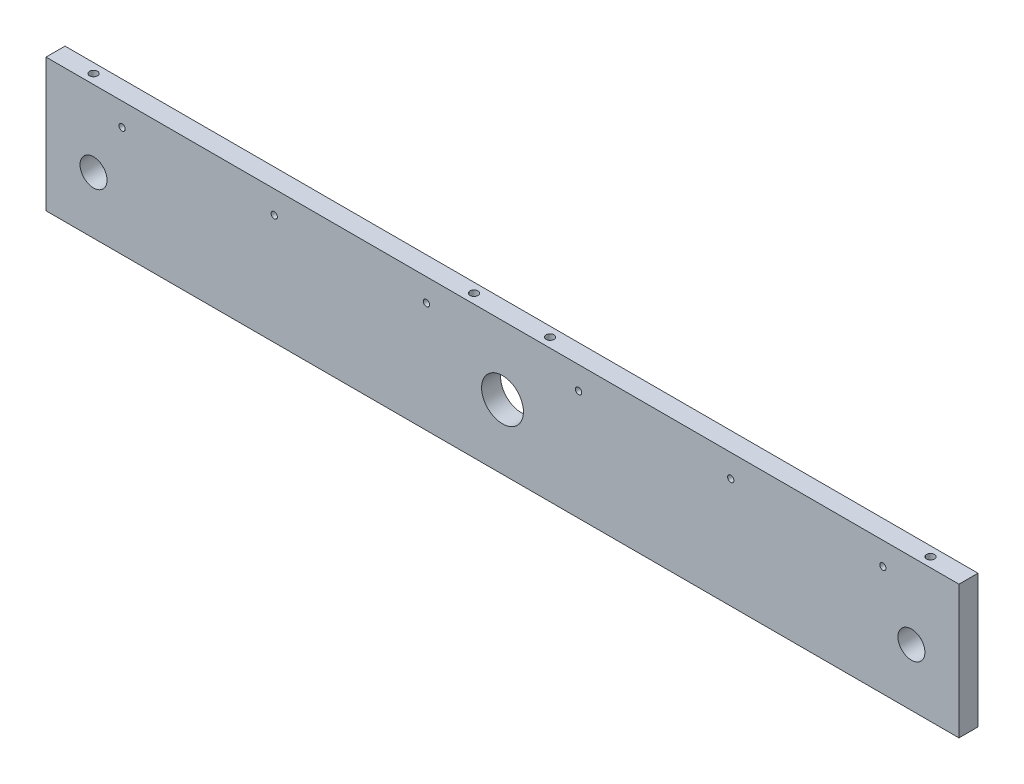
ISO-10303-21;
HEADER;
FILE_DESCRIPTION(('STEP AP214'),'2;1');
FILE_NAME('part.step','',(''),(''),'','','');
FILE_SCHEMA(('AUTOMOTIVE_DESIGN { 1 0 10303 214 1 1 1 1 }'));
ENDSEC;
DATA;
#1=APPLICATION_CONTEXT('core data for automotive mechanical design processes');
#2=APPLICATION_PROTOCOL_DEFINITION('international standard','automotive_design',2000,#1);
#3=PRODUCT_CONTEXT('',#1,'mechanical');
#4=PRODUCT('Part','Part','',(#3));
#5=PRODUCT_RELATED_PRODUCT_CATEGORY('part','',(#4));
#6=PRODUCT_DEFINITION_FORMATION('','',#4);
#7=PRODUCT_DEFINITION_CONTEXT('part definition',#1,'design');
#8=PRODUCT_DEFINITION('design','',#6,#7);
#9=PRODUCT_DEFINITION_SHAPE('','',#8);
#10=(LENGTH_UNIT() NAMED_UNIT(*) SI_UNIT(.MILLI.,.METRE.));
#11=(NAMED_UNIT(*) PLANE_ANGLE_UNIT() SI_UNIT($,.RADIAN.));
#12=(NAMED_UNIT(*) SI_UNIT($,.STERADIAN.) SOLID_ANGLE_UNIT());
#13=UNCERTAINTY_MEASURE_WITH_UNIT(LENGTH_MEASURE(1.E-05),#10,'distance_accuracy_value','');
#14=(GEOMETRIC_REPRESENTATION_CONTEXT(3) GLOBAL_UNCERTAINTY_ASSIGNED_CONTEXT((#13)) GLOBAL_UNIT_ASSIGNED_CONTEXT((#10,
#11,#12)) REPRESENTATION_CONTEXT('',''));
#15=CARTESIAN_POINT('',(0.,0.,0.));
#16=DIRECTION('',(0.,0.,1.));
#17=DIRECTION('',(1.,0.,0.));
#18=AXIS2_PLACEMENT_3D('',#15,#16,#17);
#19=CARTESIAN_POINT('',(0.,0.,10.));
#20=DIRECTION('',(0.,0.,1.));
#21=DIRECTION('',(1.,0.,0.));
#22=AXIS2_PLACEMENT_3D('',#19,#20,#21);
#23=PLANE('',#22);
#24=CARTESIAN_POINT('',(-200.,23.,10.));
#25=DIRECTION('',(0.,0.,1.));
#26=DIRECTION('',(1.,0.,0.));
#27=AXIS2_PLACEMENT_3D('',#24,#25,#26);
#28=CIRCLE('',#27,1.65000000000001);
#29=CARTESIAN_POINT('',(-198.35,23.,10.));
#30=VERTEX_POINT('',#29);
#31=EDGE_CURVE('E337',#30,#30,#28,.T.);
#32=ORIENTED_EDGE('',*,*,#31,.F.);
#33=EDGE_LOOP('',(#32));
#34=FACE_BOUND('',#33,.T.);
#35=CARTESIAN_POINT('',(-120.,23.,10.));
#36=DIRECTION('',(0.,0.,1.));
#37=DIRECTION('',(1.,0.,0.));
#38=AXIS2_PLACEMENT_3D('',#35,#36,#37);
#39=CIRCLE('',#38,1.65);
#40=CARTESIAN_POINT('',(-118.35,23.,10.));
#41=VERTEX_POINT('',#40);
#42=EDGE_CURVE('E341',#41,#41,#39,.T.);
#43=ORIENTED_EDGE('',*,*,#42,.F.);
#44=EDGE_LOOP('',(#43));
#45=FACE_BOUND('',#44,.T.);
#46=CARTESIAN_POINT('',(-40.,23.,10.));
#47=DIRECTION('',(0.,0.,1.));
#48=DIRECTION('',(1.,0.,0.));
#49=AXIS2_PLACEMENT_3D('',#46,#47,#48);
#50=CIRCLE('',#49,1.65);
#51=CARTESIAN_POINT('',(-38.35,23.,10.));
#52=VERTEX_POINT('',#51);
#53=EDGE_CURVE('E351',#52,#52,#50,.T.);
#54=ORIENTED_EDGE('',*,*,#53,.F.);
#55=EDGE_LOOP('',(#54));
#56=FACE_BOUND('',#55,.T.);
#57=CARTESIAN_POINT('',(40.,23.,10.));
#58=DIRECTION('',(0.,0.,1.));
#59=DIRECTION('',(1.,0.,0.));
#60=AXIS2_PLACEMENT_3D('',#57,#58,#59);
#61=CIRCLE('',#60,1.65);
#62=CARTESIAN_POINT('',(41.65,23.,10.));
#63=VERTEX_POINT('',#62);
#64=EDGE_CURVE('E359',#63,#63,#61,.T.);
#65=ORIENTED_EDGE('',*,*,#64,.F.);
#66=EDGE_LOOP('',(#65));
#67=FACE_BOUND('',#66,.T.);
#68=CARTESIAN_POINT('',(120.,23.,10.));
#69=DIRECTION('',(0.,0.,1.));
#70=DIRECTION('',(1.,0.,0.));
#71=AXIS2_PLACEMENT_3D('',#68,#69,#70);
#72=CIRCLE('',#71,1.65);
#73=CARTESIAN_POINT('',(121.65,23.,10.));
#74=VERTEX_POINT('',#73);
#75=EDGE_CURVE('E367',#74,#74,#72,.T.);
#76=ORIENTED_EDGE('',*,*,#75,.F.);
#77=EDGE_LOOP('',(#76));
#78=FACE_BOUND('',#77,.T.);
#79=CARTESIAN_POINT('',(200.,23.,10.));
#80=DIRECTION('',(0.,0.,1.));
#81=DIRECTION('',(1.,0.,0.));
#82=AXIS2_PLACEMENT_3D('',#79,#80,#81);
#83=CIRCLE('',#82,1.65000000000001);
#84=CARTESIAN_POINT('',(201.65,23.,10.));
#85=VERTEX_POINT('',#84);
#86=EDGE_CURVE('E375',#85,#85,#83,.T.);
#87=ORIENTED_EDGE('',*,*,#86,.F.);
#88=EDGE_LOOP('',(#87));
#89=FACE_BOUND('',#88,.T.);
#90=CARTESIAN_POINT('',(-215.,-4.99999999999998,10.));
#91=DIRECTION('',(0.,0.,1.));
#92=DIRECTION('',(1.,0.,0.));
#93=AXIS2_PLACEMENT_3D('',#90,#91,#92);
#94=CIRCLE('',#93,7.10000000000001);
#95=CARTESIAN_POINT('',(-207.9,-4.99999999999998,10.));
#96=VERTEX_POINT('',#95);
#97=EDGE_CURVE('E181',#96,#96,#94,.T.);
#98=ORIENTED_EDGE('',*,*,#97,.F.);
#99=EDGE_LOOP('',(#98));
#100=FACE_BOUND('',#99,.T.);
#101=DIRECTION('',(0.,1.,0.));
#102=VECTOR('',#101,1.);
#103=CARTESIAN_POINT('',(240.,35.,10.));
#104=LINE('',#103,#102);
#105=CARTESIAN_POINT('',(240.,-35.,10.));
#106=VERTEX_POINT('',#105);
#107=CARTESIAN_POINT('',(240.,35.,10.));
#108=VERTEX_POINT('',#107);
#109=EDGE_CURVE('E197',#106,#108,#104,.T.);
#110=ORIENTED_EDGE('',*,*,#109,.T.);
#111=DIRECTION('',(-1.,0.,0.));
#112=VECTOR('',#111,1.);
#113=CARTESIAN_POINT('',(-240.,35.,10.));
#114=LINE('',#113,#112);
#115=CARTESIAN_POINT('',(-240.,35.,10.));
#116=VERTEX_POINT('',#115);
#117=EDGE_CURVE('E94',#108,#116,#114,.T.);
#118=ORIENTED_EDGE('',*,*,#117,.T.);
#119=DIRECTION('',(0.,-1.,0.));
#120=VECTOR('',#119,1.);
#121=CARTESIAN_POINT('',(-240.,35.,10.));
#122=LINE('',#121,#120);
#123=CARTESIAN_POINT('',(-240.,-35.,10.));
#124=VERTEX_POINT('',#123);
#125=EDGE_CURVE('E202',#116,#124,#122,.T.);
#126=ORIENTED_EDGE('',*,*,#125,.T.);
#127=DIRECTION('',(1.,0.,0.));
#128=VECTOR('',#127,1.);
#129=CARTESIAN_POINT('',(-240.,-35.,10.));
#130=LINE('',#129,#128);
#131=EDGE_CURVE('E63',#124,#106,#130,.T.);
#132=ORIENTED_EDGE('',*,*,#131,.T.);
#133=EDGE_LOOP('',(#110,#118,#126,#132));
#134=FACE_BOUND('',#133,.T.);
#135=CARTESIAN_POINT('',(0.,-0.999999999999973,10.));
#136=DIRECTION('',(0.,0.,1.));
#137=DIRECTION('',(1.,0.,0.));
#138=AXIS2_PLACEMENT_3D('',#135,#136,#137);
#139=CIRCLE('',#138,11.);
#140=CARTESIAN_POINT('',(11.,-0.999999999999973,10.));
#141=VERTEX_POINT('',#140);
#142=EDGE_CURVE('E189',#141,#141,#139,.T.);
#143=ORIENTED_EDGE('',*,*,#142,.F.);
#144=EDGE_LOOP('',(#143));
#145=FACE_BOUND('',#144,.T.);
#146=CARTESIAN_POINT('',(215.,-4.99999999999992,10.));
#147=DIRECTION('',(0.,0.,1.));
#148=DIRECTION('',(-1.,0.,0.));
#149=AXIS2_PLACEMENT_3D('',#146,#147,#148);
#150=CIRCLE('',#149,7.10000000000001);
#151=CARTESIAN_POINT('',(207.9,-4.99999999999992,10.));
#152=VERTEX_POINT('',#151);
#153=EDGE_CURVE('E173',#152,#152,#150,.T.);
#154=ORIENTED_EDGE('',*,*,#153,.F.);
#155=EDGE_LOOP('',(#154));
#156=FACE_BOUND('',#155,.T.);
#157=ADVANCED_FACE('F45',(#34,#45,#56,#67,#78,#89,#100,#134,#145,#156),#23,.T.);
#158=CARTESIAN_POINT('',(0.,0.,0.));
#159=DIRECTION('',(0.,0.,1.));
#160=DIRECTION('',(1.,0.,0.));
#161=AXIS2_PLACEMENT_3D('',#158,#159,#160);
#162=PLANE('',#161);
#163=CARTESIAN_POINT('',(-200.,23.,0.));
#164=DIRECTION('',(0.,0.,1.));
#165=DIRECTION('',(1.,0.,0.));
#166=AXIS2_PLACEMENT_3D('',#163,#164,#165);
#167=CIRCLE('',#166,1.64999999999998);
#168=CARTESIAN_POINT('',(-198.35,23.,0.));
#169=VERTEX_POINT('',#168);
#170=EDGE_CURVE('E335',#169,#169,#167,.T.);
#171=ORIENTED_EDGE('',*,*,#170,.T.);
#172=EDGE_LOOP('',(#171));
#173=FACE_BOUND('',#172,.T.);
#174=CARTESIAN_POINT('',(-120.,23.,0.));
#175=DIRECTION('',(0.,0.,1.));
#176=DIRECTION('',(1.,0.,0.));
#177=AXIS2_PLACEMENT_3D('',#174,#175,#176);
#178=CIRCLE('',#177,1.65);
#179=CARTESIAN_POINT('',(-118.35,23.,0.));
#180=VERTEX_POINT('',#179);
#181=EDGE_CURVE('E347',#180,#180,#178,.T.);
#182=ORIENTED_EDGE('',*,*,#181,.T.);
#183=EDGE_LOOP('',(#182));
#184=FACE_BOUND('',#183,.T.);
#185=CARTESIAN_POINT('',(-40.,23.,0.));
#186=DIRECTION('',(0.,0.,1.));
#187=DIRECTION('',(1.,0.,0.));
#188=AXIS2_PLACEMENT_3D('',#185,#186,#187);
#189=CIRCLE('',#188,1.65);
#190=CARTESIAN_POINT('',(-38.35,23.,0.));
#191=VERTEX_POINT('',#190);
#192=EDGE_CURVE('E355',#191,#191,#189,.T.);
#193=ORIENTED_EDGE('',*,*,#192,.T.);
#194=EDGE_LOOP('',(#193));
#195=FACE_BOUND('',#194,.T.);
#196=CARTESIAN_POINT('',(40.,23.,0.));
#197=DIRECTION('',(0.,0.,1.));
#198=DIRECTION('',(1.,0.,0.));
#199=AXIS2_PLACEMENT_3D('',#196,#197,#198);
#200=CIRCLE('',#199,1.65);
#201=CARTESIAN_POINT('',(41.65,23.,0.));
#202=VERTEX_POINT('',#201);
#203=EDGE_CURVE('E363',#202,#202,#200,.T.);
#204=ORIENTED_EDGE('',*,*,#203,.T.);
#205=EDGE_LOOP('',(#204));
#206=FACE_BOUND('',#205,.T.);
#207=CARTESIAN_POINT('',(120.,23.,0.));
#208=DIRECTION('',(0.,0.,1.));
#209=DIRECTION('',(1.,0.,0.));
#210=AXIS2_PLACEMENT_3D('',#207,#208,#209);
#211=CIRCLE('',#210,1.65);
#212=CARTESIAN_POINT('',(121.65,23.,0.));
#213=VERTEX_POINT('',#212);
#214=EDGE_CURVE('E371',#213,#213,#211,.T.);
#215=ORIENTED_EDGE('',*,*,#214,.T.);
#216=EDGE_LOOP('',(#215));
#217=FACE_BOUND('',#216,.T.);
#218=CARTESIAN_POINT('',(200.,23.,0.));
#219=DIRECTION('',(0.,0.,1.));
#220=DIRECTION('',(1.,0.,0.));
#221=AXIS2_PLACEMENT_3D('',#218,#219,#220);
#222=CIRCLE('',#221,1.64999999999998);
#223=CARTESIAN_POINT('',(201.65,23.,0.));
#224=VERTEX_POINT('',#223);
#225=EDGE_CURVE('E133',#224,#224,#222,.T.);
#226=ORIENTED_EDGE('',*,*,#225,.T.);
#227=EDGE_LOOP('',(#226));
#228=FACE_BOUND('',#227,.T.);
#229=DIRECTION('',(0.,1.,0.));
#230=VECTOR('',#229,1.);
#231=CARTESIAN_POINT('',(240.,35.,0.));
#232=LINE('',#231,#230);
#233=CARTESIAN_POINT('',(240.,-35.,0.));
#234=VERTEX_POINT('',#233);
#235=CARTESIAN_POINT('',(240.,35.,0.));
#236=VERTEX_POINT('',#235);
#237=EDGE_CURVE('E193',#234,#236,#232,.T.);
#238=ORIENTED_EDGE('',*,*,#237,.F.);
#239=DIRECTION('',(1.,0.,0.));
#240=VECTOR('',#239,1.);
#241=CARTESIAN_POINT('',(-240.,-35.,0.));
#242=LINE('',#241,#240);
#243=CARTESIAN_POINT('',(-240.,-35.,0.));
#244=VERTEX_POINT('',#243);
#245=EDGE_CURVE('E87',#244,#234,#242,.T.);
#246=ORIENTED_EDGE('',*,*,#245,.F.);
#247=DIRECTION('',(0.,-1.,0.));
#248=VECTOR('',#247,1.);
#249=CARTESIAN_POINT('',(-240.,35.,0.));
#250=LINE('',#249,#248);
#251=CARTESIAN_POINT('',(-240.,35.,0.));
#252=VERTEX_POINT('',#251);
#253=EDGE_CURVE('E81',#252,#244,#250,.T.);
#254=ORIENTED_EDGE('',*,*,#253,.F.);
#255=DIRECTION('',(-1.,0.,0.));
#256=VECTOR('',#255,1.);
#257=CARTESIAN_POINT('',(-240.,35.,0.));
#258=LINE('',#257,#256);
#259=EDGE_CURVE('E211',#236,#252,#258,.T.);
#260=ORIENTED_EDGE('',*,*,#259,.F.);
#261=EDGE_LOOP('',(#238,#246,#254,#260));
#262=FACE_BOUND('',#261,.T.);
#263=CARTESIAN_POINT('',(0.,-0.999999999999973,0.));
#264=DIRECTION('',(0.,0.,1.));
#265=DIRECTION('',(1.,0.,0.));
#266=AXIS2_PLACEMENT_3D('',#263,#264,#265);
#267=CIRCLE('',#266,11.);
#268=CARTESIAN_POINT('',(11.,-0.999999999999973,0.));
#269=VERTEX_POINT('',#268);
#270=EDGE_CURVE('E185',#269,#269,#267,.T.);
#271=ORIENTED_EDGE('',*,*,#270,.T.);
#272=EDGE_LOOP('',(#271));
#273=FACE_BOUND('',#272,.T.);
#274=CARTESIAN_POINT('',(-215.,-4.99999999999998,0.));
#275=DIRECTION('',(0.,0.,1.));
#276=DIRECTION('',(1.,0.,0.));
#277=AXIS2_PLACEMENT_3D('',#274,#275,#276);
#278=CIRCLE('',#277,7.10000000000001);
#279=CARTESIAN_POINT('',(-207.9,-4.99999999999998,0.));
#280=VERTEX_POINT('',#279);
#281=EDGE_CURVE('E177',#280,#280,#278,.T.);
#282=ORIENTED_EDGE('',*,*,#281,.T.);
#283=EDGE_LOOP('',(#282));
#284=FACE_BOUND('',#283,.T.);
#285=CARTESIAN_POINT('',(215.,-4.99999999999992,0.));
#286=DIRECTION('',(0.,0.,1.));
#287=DIRECTION('',(-1.,0.,0.));
#288=AXIS2_PLACEMENT_3D('',#285,#286,#287);
#289=CIRCLE('',#288,7.10000000000001);
#290=CARTESIAN_POINT('',(207.9,-4.99999999999992,0.));
#291=VERTEX_POINT('',#290);
#292=EDGE_CURVE('E172',#291,#291,#289,.T.);
#293=ORIENTED_EDGE('',*,*,#292,.T.);
#294=EDGE_LOOP('',(#293));
#295=FACE_BOUND('',#294,.T.);
#296=ADVANCED_FACE('F227',(#173,#184,#195,#206,#217,#228,#262,#273,#284,#295),#162,.F.);
#297=CARTESIAN_POINT('',(240.,35.,10.));
#298=DIRECTION('',(-1.,0.,0.));
#299=DIRECTION('',(0.,0.,1.));
#300=AXIS2_PLACEMENT_3D('',#297,#298,#299);
#301=PLANE('',#300);
#302=ORIENTED_EDGE('',*,*,#237,.T.);
#303=DIRECTION('',(0.,0.,-1.));
#304=VECTOR('',#303,1.);
#305=CARTESIAN_POINT('',(240.,35.,10.));
#306=LINE('',#305,#304);
#307=EDGE_CURVE('E11',#108,#236,#306,.T.);
#308=ORIENTED_EDGE('',*,*,#307,.F.);
#309=ORIENTED_EDGE('',*,*,#109,.F.);
#310=DIRECTION('',(0.,0.,-1.));
#311=VECTOR('',#310,1.);
#312=CARTESIAN_POINT('',(240.,-35.,10.));
#313=LINE('',#312,#311);
#314=EDGE_CURVE('E207',#106,#234,#313,.T.);
#315=ORIENTED_EDGE('',*,*,#314,.T.);
#316=EDGE_LOOP('',(#302,#308,#309,#315));
#317=FACE_BOUND('',#316,.T.);
#318=ADVANCED_FACE('F47',(#317),#301,.F.);
#319=CARTESIAN_POINT('',(-240.,35.,10.));
#320=DIRECTION('',(0.,-1.,0.));
#321=DIRECTION('',(0.,0.,-1.));
#322=AXIS2_PLACEMENT_3D('',#319,#320,#321);
#323=PLANE('',#322);
#324=CARTESIAN_POINT('',(-220.,35.,5.00000000000006));
#325=DIRECTION('',(0.,1.,0.));
#326=DIRECTION('',(0.,0.,1.));
#327=AXIS2_PLACEMENT_3D('',#324,#325,#326);
#328=CIRCLE('',#327,2.09999999999999);
#329=CARTESIAN_POINT('',(-220.,35.,7.10000000000005));
#330=VERTEX_POINT('',#329);
#331=EDGE_CURVE('E140',#330,#330,#328,.T.);
#332=ORIENTED_EDGE('',*,*,#331,.F.);
#333=EDGE_LOOP('',(#332));
#334=FACE_BOUND('',#333,.T.);
#335=CARTESIAN_POINT('',(-20.,35.,5.));
#336=DIRECTION('',(0.,1.,0.));
#337=DIRECTION('',(0.,0.,1.));
#338=AXIS2_PLACEMENT_3D('',#335,#336,#337);
#339=CIRCLE('',#338,2.09999999999999);
#340=CARTESIAN_POINT('',(-20.,35.,7.09999999999999));
#341=VERTEX_POINT('',#340);
#342=EDGE_CURVE('E148',#341,#341,#339,.T.);
#343=ORIENTED_EDGE('',*,*,#342,.F.);
#344=EDGE_LOOP('',(#343));
#345=FACE_BOUND('',#344,.T.);
#346=CARTESIAN_POINT('',(19.9999999999999,35.,5.));
#347=DIRECTION('',(0.,1.,0.));
#348=DIRECTION('',(0.,0.,1.));
#349=AXIS2_PLACEMENT_3D('',#346,#347,#348);
#350=CIRCLE('',#349,2.09999999999999);
#351=CARTESIAN_POINT('',(19.9999999999999,35.,7.09999999999999));
#352=VERTEX_POINT('',#351);
#353=EDGE_CURVE('E156',#352,#352,#350,.T.);
#354=ORIENTED_EDGE('',*,*,#353,.F.);
#355=EDGE_LOOP('',(#354));
#356=FACE_BOUND('',#355,.T.);
#357=CARTESIAN_POINT('',(220.,35.,5.00000000000006));
#358=DIRECTION('',(0.,1.,0.));
#359=DIRECTION('',(0.,0.,1.));
#360=AXIS2_PLACEMENT_3D('',#357,#358,#359);
#361=CIRCLE('',#360,2.09999999999999);
#362=CARTESIAN_POINT('',(220.,35.,7.10000000000005));
#363=VERTEX_POINT('',#362);
#364=EDGE_CURVE('E164',#363,#363,#361,.T.);
#365=ORIENTED_EDGE('',*,*,#364,.F.);
#366=EDGE_LOOP('',(#365));
#367=FACE_BOUND('',#366,.T.);
#368=ORIENTED_EDGE('',*,*,#259,.T.);
#369=DIRECTION('',(0.,0.,-1.));
#370=VECTOR('',#369,1.);
#371=CARTESIAN_POINT('',(-240.,35.,10.));
#372=LINE('',#371,#370);
#373=EDGE_CURVE('E55',#116,#252,#372,.T.);
#374=ORIENTED_EDGE('',*,*,#373,.F.);
#375=ORIENTED_EDGE('',*,*,#117,.F.);
#376=ORIENTED_EDGE('',*,*,#307,.T.);
#377=EDGE_LOOP('',(#368,#374,#375,#376));
#378=FACE_BOUND('',#377,.T.);
#379=ADVANCED_FACE('F244',(#334,#345,#356,#367,#378),#323,.F.);
#380=CARTESIAN_POINT('',(-240.,35.,10.));
#381=DIRECTION('',(1.,0.,0.));
#382=DIRECTION('',(0.,1.,0.));
#383=AXIS2_PLACEMENT_3D('',#380,#381,#382);
#384=PLANE('',#383);
#385=ORIENTED_EDGE('',*,*,#253,.T.);
#386=DIRECTION('',(0.,0.,-1.));
#387=VECTOR('',#386,1.);
#388=CARTESIAN_POINT('',(-240.,-35.,10.));
#389=LINE('',#388,#387);
#390=EDGE_CURVE('E220',#124,#244,#389,.T.);
#391=ORIENTED_EDGE('',*,*,#390,.F.);
#392=ORIENTED_EDGE('',*,*,#125,.F.);
#393=ORIENTED_EDGE('',*,*,#373,.T.);
#394=EDGE_LOOP('',(#385,#391,#392,#393));
#395=FACE_BOUND('',#394,.T.);
#396=ADVANCED_FACE('F224',(#395),#384,.F.);
#397=CARTESIAN_POINT('',(-240.,-35.,10.));
#398=DIRECTION('',(0.,1.,0.));
#399=DIRECTION('',(0.,0.,1.));
#400=AXIS2_PLACEMENT_3D('',#397,#398,#399);
#401=PLANE('',#400);
#402=CARTESIAN_POINT('',(-220.,-35.,5.));
#403=DIRECTION('',(0.,-1.,0.));
#404=DIRECTION('',(0.,0.,-1.));
#405=AXIS2_PLACEMENT_3D('',#402,#403,#404);
#406=CIRCLE('',#405,2.09999999999999);
#407=CARTESIAN_POINT('',(-220.,-35.,2.90000000000001));
#408=VERTEX_POINT('',#407);
#409=EDGE_CURVE('E125',#408,#408,#406,.T.);
#410=ORIENTED_EDGE('',*,*,#409,.F.);
#411=EDGE_LOOP('',(#410));
#412=FACE_BOUND('',#411,.T.);
#413=CARTESIAN_POINT('',(220.,-35.,5.00000000000122));
#414=DIRECTION('',(0.,-1.,0.));
#415=DIRECTION('',(0.,0.,-1.));
#416=AXIS2_PLACEMENT_3D('',#413,#414,#415);
#417=CIRCLE('',#416,2.09999999999999);
#418=CARTESIAN_POINT('',(220.,-35.,2.90000000000123));
#419=VERTEX_POINT('',#418);
#420=EDGE_CURVE('E124',#419,#419,#417,.T.);
#421=ORIENTED_EDGE('',*,*,#420,.F.);
#422=EDGE_LOOP('',(#421));
#423=FACE_BOUND('',#422,.T.);
#424=ORIENTED_EDGE('',*,*,#245,.T.);
#425=ORIENTED_EDGE('',*,*,#314,.F.);
#426=ORIENTED_EDGE('',*,*,#131,.F.);
#427=ORIENTED_EDGE('',*,*,#390,.T.);
#428=EDGE_LOOP('',(#424,#425,#426,#427));
#429=FACE_BOUND('',#428,.T.);
#430=ADVANCED_FACE('F232',(#412,#423,#429),#401,.F.);
#431=CARTESIAN_POINT('',(0.,-0.999999999999973,10.));
#432=DIRECTION('',(0.,0.,-1.));
#433=DIRECTION('',(-1.,0.,0.));
#434=AXIS2_PLACEMENT_3D('',#431,#432,#433);
#435=CYLINDRICAL_SURFACE('',#434,11.);
#436=ORIENTED_EDGE('',*,*,#142,.T.);
#437=EDGE_LOOP('',(#436));
#438=FACE_BOUND('',#437,.T.);
#439=ORIENTED_EDGE('',*,*,#270,.F.);
#440=EDGE_LOOP('',(#439));
#441=FACE_BOUND('',#440,.T.);
#442=ADVANCED_FACE('F234',(#438,#441),#435,.F.);
#443=CARTESIAN_POINT('',(-215.,-4.99999999999998,10.));
#444=DIRECTION('',(0.,0.,-1.));
#445=DIRECTION('',(-1.,0.,0.));
#446=AXIS2_PLACEMENT_3D('',#443,#444,#445);
#447=CYLINDRICAL_SURFACE('',#446,7.10000000000001);
#448=ORIENTED_EDGE('',*,*,#97,.T.);
#449=EDGE_LOOP('',(#448));
#450=FACE_BOUND('',#449,.T.);
#451=ORIENTED_EDGE('',*,*,#281,.F.);
#452=EDGE_LOOP('',(#451));
#453=FACE_BOUND('',#452,.T.);
#454=ADVANCED_FACE('F241',(#450,#453),#447,.F.);
#455=CARTESIAN_POINT('',(215.,-4.99999999999992,10.));
#456=DIRECTION('',(0.,0.,-1.));
#457=DIRECTION('',(-1.,0.,0.));
#458=AXIS2_PLACEMENT_3D('',#455,#456,#457);
#459=CYLINDRICAL_SURFACE('',#458,7.10000000000001);
#460=ORIENTED_EDGE('',*,*,#153,.T.);
#461=EDGE_LOOP('',(#460));
#462=FACE_BOUND('',#461,.T.);
#463=ORIENTED_EDGE('',*,*,#292,.F.);
#464=EDGE_LOOP('',(#463));
#465=FACE_BOUND('',#464,.T.);
#466=ADVANCED_FACE('F261',(#462,#465),#459,.F.);
#467=CARTESIAN_POINT('',(220.,25.,5.00000000000006));
#468=DIRECTION('',(0.,1.,0.));
#469=DIRECTION('',(0.,0.,1.));
#470=AXIS2_PLACEMENT_3D('',#467,#468,#469);
#471=CONICAL_SURFACE('',#470,2.09999999999999,1.02974425867665);
#472=CARTESIAN_POINT('',(220.,23.7381927000421,5.00000000000006));
#473=VERTEX_POINT('',#472);
#474=VERTEX_LOOP('',#473);
#475=FACE_BOUND('',#474,.T.);
#476=CARTESIAN_POINT('',(220.,25.,5.00000000000006));
#477=DIRECTION('',(0.,1.,0.));
#478=DIRECTION('',(0.,0.,1.));
#479=AXIS2_PLACEMENT_3D('',#476,#477,#478);
#480=CIRCLE('',#479,2.09999999999999);
#481=CARTESIAN_POINT('',(220.,25.,7.10000000000005));
#482=VERTEX_POINT('',#481);
#483=EDGE_CURVE('E168',#482,#482,#480,.T.);
#484=ORIENTED_EDGE('',*,*,#483,.T.);
#485=EDGE_LOOP('',(#484));
#486=FACE_BOUND('',#485,.T.);
#487=ADVANCED_FACE('F265',(#475,#486),#471,.F.);
#488=CARTESIAN_POINT('',(220.,35.,5.00000000000006));
#489=DIRECTION('',(0.,1.,0.));
#490=DIRECTION('',(0.,0.,1.));
#491=AXIS2_PLACEMENT_3D('',#488,#489,#490);
#492=CYLINDRICAL_SURFACE('',#491,2.09999999999999);
#493=ORIENTED_EDGE('',*,*,#483,.F.);
#494=EDGE_LOOP('',(#493));
#495=FACE_BOUND('',#494,.T.);
#496=ORIENTED_EDGE('',*,*,#364,.T.);
#497=EDGE_LOOP('',(#496));
#498=FACE_BOUND('',#497,.T.);
#499=ADVANCED_FACE('F269',(#495,#498),#492,.F.);
#500=CARTESIAN_POINT('',(19.9999999999999,25.,5.));
#501=DIRECTION('',(0.,1.,0.));
#502=DIRECTION('',(0.,0.,1.));
#503=AXIS2_PLACEMENT_3D('',#500,#501,#502);
#504=CONICAL_SURFACE('',#503,2.1,1.02974425867665);
#505=CARTESIAN_POINT('',(19.9999999999999,23.7381927000421,5.));
#506=VERTEX_POINT('',#505);
#507=VERTEX_LOOP('',#506);
#508=FACE_BOUND('',#507,.T.);
#509=CARTESIAN_POINT('',(19.9999999999999,25.,5.));
#510=DIRECTION('',(0.,1.,0.));
#511=DIRECTION('',(0.,0.,1.));
#512=AXIS2_PLACEMENT_3D('',#509,#510,#511);
#513=CIRCLE('',#512,2.1);
#514=CARTESIAN_POINT('',(19.9999999999999,25.,7.1));
#515=VERTEX_POINT('',#514);
#516=EDGE_CURVE('E160',#515,#515,#513,.T.);
#517=ORIENTED_EDGE('',*,*,#516,.T.);
#518=EDGE_LOOP('',(#517));
#519=FACE_BOUND('',#518,.T.);
#520=ADVANCED_FACE('F273',(#508,#519),#504,.F.);
#521=CARTESIAN_POINT('',(19.9999999999999,35.,5.));
#522=DIRECTION('',(0.,1.,0.));
#523=DIRECTION('',(0.,0.,1.));
#524=AXIS2_PLACEMENT_3D('',#521,#522,#523);
#525=CYLINDRICAL_SURFACE('',#524,2.09999999999999);
#526=ORIENTED_EDGE('',*,*,#516,.F.);
#527=EDGE_LOOP('',(#526));
#528=FACE_BOUND('',#527,.T.);
#529=ORIENTED_EDGE('',*,*,#353,.T.);
#530=EDGE_LOOP('',(#529));
#531=FACE_BOUND('',#530,.T.);
#532=ADVANCED_FACE('F277',(#528,#531),#525,.F.);
#533=CARTESIAN_POINT('',(-20.,25.,5.));
#534=DIRECTION('',(0.,1.,0.));
#535=DIRECTION('',(0.,0.,1.));
#536=AXIS2_PLACEMENT_3D('',#533,#534,#535);
#537=CONICAL_SURFACE('',#536,2.1,1.02974425867665);
#538=CARTESIAN_POINT('',(-20.,23.7381927000421,5.));
#539=VERTEX_POINT('',#538);
#540=VERTEX_LOOP('',#539);
#541=FACE_BOUND('',#540,.T.);
#542=CARTESIAN_POINT('',(-20.,25.,5.));
#543=DIRECTION('',(0.,1.,0.));
#544=DIRECTION('',(0.,0.,1.));
#545=AXIS2_PLACEMENT_3D('',#542,#543,#544);
#546=CIRCLE('',#545,2.1);
#547=CARTESIAN_POINT('',(-20.,25.,7.1));
#548=VERTEX_POINT('',#547);
#549=EDGE_CURVE('E152',#548,#548,#546,.T.);
#550=ORIENTED_EDGE('',*,*,#549,.T.);
#551=EDGE_LOOP('',(#550));
#552=FACE_BOUND('',#551,.T.);
#553=ADVANCED_FACE('F281',(#541,#552),#537,.F.);
#554=CARTESIAN_POINT('',(-20.,35.,5.));
#555=DIRECTION('',(0.,1.,0.));
#556=DIRECTION('',(0.,0.,1.));
#557=AXIS2_PLACEMENT_3D('',#554,#555,#556);
#558=CYLINDRICAL_SURFACE('',#557,2.09999999999999);
#559=ORIENTED_EDGE('',*,*,#549,.F.);
#560=EDGE_LOOP('',(#559));
#561=FACE_BOUND('',#560,.T.);
#562=ORIENTED_EDGE('',*,*,#342,.T.);
#563=EDGE_LOOP('',(#562));
#564=FACE_BOUND('',#563,.T.);
#565=ADVANCED_FACE('F285',(#561,#564),#558,.F.);
#566=CARTESIAN_POINT('',(-220.,25.,5.00000000000006));
#567=DIRECTION('',(0.,1.,0.));
#568=DIRECTION('',(0.,0.,1.));
#569=AXIS2_PLACEMENT_3D('',#566,#567,#568);
#570=CONICAL_SURFACE('',#569,2.09999999999999,1.02974425867665);
#571=CARTESIAN_POINT('',(-220.,23.7381927000421,5.00000000000006));
#572=VERTEX_POINT('',#571);
#573=VERTEX_LOOP('',#572);
#574=FACE_BOUND('',#573,.T.);
#575=CARTESIAN_POINT('',(-220.,25.,5.00000000000006));
#576=DIRECTION('',(0.,1.,0.));
#577=DIRECTION('',(0.,0.,1.));
#578=AXIS2_PLACEMENT_3D('',#575,#576,#577);
#579=CIRCLE('',#578,2.09999999999999);
#580=CARTESIAN_POINT('',(-220.,25.,7.10000000000005));
#581=VERTEX_POINT('',#580);
#582=EDGE_CURVE('E144',#581,#581,#579,.T.);
#583=ORIENTED_EDGE('',*,*,#582,.T.);
#584=EDGE_LOOP('',(#583));
#585=FACE_BOUND('',#584,.T.);
#586=ADVANCED_FACE('F289',(#574,#585),#570,.F.);
#587=CARTESIAN_POINT('',(-220.,35.,5.00000000000006));
#588=DIRECTION('',(0.,1.,0.));
#589=DIRECTION('',(0.,0.,1.));
#590=AXIS2_PLACEMENT_3D('',#587,#588,#589);
#591=CYLINDRICAL_SURFACE('',#590,2.09999999999999);
#592=ORIENTED_EDGE('',*,*,#582,.F.);
#593=EDGE_LOOP('',(#592));
#594=FACE_BOUND('',#593,.T.);
#595=ORIENTED_EDGE('',*,*,#331,.T.);
#596=EDGE_LOOP('',(#595));
#597=FACE_BOUND('',#596,.T.);
#598=ADVANCED_FACE('F293',(#594,#597),#591,.F.);
#599=CARTESIAN_POINT('',(220.,-22.6,5.00000000000122));
#600=DIRECTION('',(0.,-1.,0.));
#601=DIRECTION('',(0.,0.,-1.));
#602=AXIS2_PLACEMENT_3D('',#599,#600,#601);
#603=CONICAL_SURFACE('',#602,2.09999999999999,1.02974425867665);
#604=CARTESIAN_POINT('',(220.,-21.3381927000421,5.00000000000122));
#605=VERTEX_POINT('',#604);
#606=VERTEX_LOOP('',#605);
#607=FACE_BOUND('',#606,.T.);
#608=CARTESIAN_POINT('',(220.,-22.6,5.00000000000122));
#609=DIRECTION('',(0.,-1.,0.));
#610=DIRECTION('',(0.,0.,-1.));
#611=AXIS2_PLACEMENT_3D('',#608,#609,#610);
#612=CIRCLE('',#611,2.09999999999999);
#613=CARTESIAN_POINT('',(220.,-22.6,2.90000000000123));
#614=VERTEX_POINT('',#613);
#615=EDGE_CURVE('E130',#614,#614,#612,.T.);
#616=ORIENTED_EDGE('',*,*,#615,.T.);
#617=EDGE_LOOP('',(#616));
#618=FACE_BOUND('',#617,.T.);
#619=ADVANCED_FACE('F297',(#607,#618),#603,.F.);
#620=CARTESIAN_POINT('',(220.,-35.,5.00000000000122));
#621=DIRECTION('',(0.,-1.,0.));
#622=DIRECTION('',(0.,0.,-1.));
#623=AXIS2_PLACEMENT_3D('',#620,#621,#622);
#624=CYLINDRICAL_SURFACE('',#623,2.09999999999999);
#625=ORIENTED_EDGE('',*,*,#615,.F.);
#626=EDGE_LOOP('',(#625));
#627=FACE_BOUND('',#626,.T.);
#628=ORIENTED_EDGE('',*,*,#420,.T.);
#629=EDGE_LOOP('',(#628));
#630=FACE_BOUND('',#629,.T.);
#631=ADVANCED_FACE('F117',(#627,#630),#624,.F.);
#632=CARTESIAN_POINT('',(-220.,-22.6,5.));
#633=DIRECTION('',(0.,-1.,0.));
#634=DIRECTION('',(0.,0.,-1.));
#635=AXIS2_PLACEMENT_3D('',#632,#633,#634);
#636=CONICAL_SURFACE('',#635,2.09999999999999,1.02974425867665);
#637=CARTESIAN_POINT('',(-220.,-21.3381927000421,5.));
#638=VERTEX_POINT('',#637);
#639=VERTEX_LOOP('',#638);
#640=FACE_BOUND('',#639,.T.);
#641=CARTESIAN_POINT('',(-220.,-22.6,5.));
#642=DIRECTION('',(0.,-1.,0.));
#643=DIRECTION('',(0.,0.,-1.));
#644=AXIS2_PLACEMENT_3D('',#641,#642,#643);
#645=CIRCLE('',#644,2.09999999999999);
#646=CARTESIAN_POINT('',(-220.,-22.6,2.90000000000001));
#647=VERTEX_POINT('',#646);
#648=EDGE_CURVE('E121',#647,#647,#645,.T.);
#649=ORIENTED_EDGE('',*,*,#648,.T.);
#650=EDGE_LOOP('',(#649));
#651=FACE_BOUND('',#650,.T.);
#652=ADVANCED_FACE('F113',(#640,#651),#636,.F.);
#653=CARTESIAN_POINT('',(-220.,-35.,5.));
#654=DIRECTION('',(0.,-1.,0.));
#655=DIRECTION('',(0.,0.,-1.));
#656=AXIS2_PLACEMENT_3D('',#653,#654,#655);
#657=CYLINDRICAL_SURFACE('',#656,2.09999999999999);
#658=ORIENTED_EDGE('',*,*,#648,.F.);
#659=EDGE_LOOP('',(#658));
#660=FACE_BOUND('',#659,.T.);
#661=ORIENTED_EDGE('',*,*,#409,.T.);
#662=EDGE_LOOP('',(#661));
#663=FACE_BOUND('',#662,.T.);
#664=ADVANCED_FACE('F116',(#660,#663),#657,.F.);
#665=CARTESIAN_POINT('',(200.,23.,10.));
#666=DIRECTION('',(0.,0.,1.));
#667=DIRECTION('',(1.,0.,0.));
#668=AXIS2_PLACEMENT_3D('',#665,#666,#667);
#669=CYLINDRICAL_SURFACE('',#668,1.65);
#670=ORIENTED_EDGE('',*,*,#225,.F.);
#671=EDGE_LOOP('',(#670));
#672=FACE_BOUND('',#671,.T.);
#673=ORIENTED_EDGE('',*,*,#86,.T.);
#674=EDGE_LOOP('',(#673));
#675=FACE_BOUND('',#674,.T.);
#676=ADVANCED_FACE('F307',(#672,#675),#669,.F.);
#677=CARTESIAN_POINT('',(120.,23.,10.));
#678=DIRECTION('',(0.,0.,1.));
#679=DIRECTION('',(1.,0.,0.));
#680=AXIS2_PLACEMENT_3D('',#677,#678,#679);
#681=CYLINDRICAL_SURFACE('',#680,1.65);
#682=ORIENTED_EDGE('',*,*,#214,.F.);
#683=EDGE_LOOP('',(#682));
#684=FACE_BOUND('',#683,.T.);
#685=ORIENTED_EDGE('',*,*,#75,.T.);
#686=EDGE_LOOP('',(#685));
#687=FACE_BOUND('',#686,.T.);
#688=ADVANCED_FACE('F310',(#684,#687),#681,.F.);
#689=CARTESIAN_POINT('',(40.,23.,10.));
#690=DIRECTION('',(0.,0.,1.));
#691=DIRECTION('',(1.,0.,0.));
#692=AXIS2_PLACEMENT_3D('',#689,#690,#691);
#693=CYLINDRICAL_SURFACE('',#692,1.65);
#694=ORIENTED_EDGE('',*,*,#203,.F.);
#695=EDGE_LOOP('',(#694));
#696=FACE_BOUND('',#695,.T.);
#697=ORIENTED_EDGE('',*,*,#64,.T.);
#698=EDGE_LOOP('',(#697));
#699=FACE_BOUND('',#698,.T.);
#700=ADVANCED_FACE('F314',(#696,#699),#693,.F.);
#701=CARTESIAN_POINT('',(-40.,23.,10.));
#702=DIRECTION('',(0.,0.,1.));
#703=DIRECTION('',(1.,0.,0.));
#704=AXIS2_PLACEMENT_3D('',#701,#702,#703);
#705=CYLINDRICAL_SURFACE('',#704,1.65);
#706=ORIENTED_EDGE('',*,*,#192,.F.);
#707=EDGE_LOOP('',(#706));
#708=FACE_BOUND('',#707,.T.);
#709=ORIENTED_EDGE('',*,*,#53,.T.);
#710=EDGE_LOOP('',(#709));
#711=FACE_BOUND('',#710,.T.);
#712=ADVANCED_FACE('F318',(#708,#711),#705,.F.);
#713=CARTESIAN_POINT('',(-120.,23.,10.));
#714=DIRECTION('',(0.,0.,1.));
#715=DIRECTION('',(1.,0.,0.));
#716=AXIS2_PLACEMENT_3D('',#713,#714,#715);
#717=CYLINDRICAL_SURFACE('',#716,1.65);
#718=ORIENTED_EDGE('',*,*,#181,.F.);
#719=EDGE_LOOP('',(#718));
#720=FACE_BOUND('',#719,.T.);
#721=ORIENTED_EDGE('',*,*,#42,.T.);
#722=EDGE_LOOP('',(#721));
#723=FACE_BOUND('',#722,.T.);
#724=ADVANCED_FACE('F322',(#720,#723),#717,.F.);
#725=CARTESIAN_POINT('',(-200.,23.,10.));
#726=DIRECTION('',(0.,0.,1.));
#727=DIRECTION('',(1.,0.,0.));
#728=AXIS2_PLACEMENT_3D('',#725,#726,#727);
#729=CYLINDRICAL_SURFACE('',#728,1.65);
#730=ORIENTED_EDGE('',*,*,#170,.F.);
#731=EDGE_LOOP('',(#730));
#732=FACE_BOUND('',#731,.T.);
#733=ORIENTED_EDGE('',*,*,#31,.T.);
#734=EDGE_LOOP('',(#733));
#735=FACE_BOUND('',#734,.T.);
#736=ADVANCED_FACE('F326',(#732,#735),#729,.F.);
#737=CLOSED_SHELL('',(#157,#296,#318,#379,#396,#430,#442,#454,#466,#487,#499,#520,#532,#553,
#565,#586,#598,#619,#631,#652,#664,#676,#688,#700,#712,#724,#736));
#738=MANIFOLD_SOLID_BREP('B2',#737);
#739=ADVANCED_BREP_SHAPE_REPRESENTATION('',(#18,#738),#14);
#740=SHAPE_DEFINITION_REPRESENTATION(#9,#739);
ENDSEC;
END-ISO-10303-21;
